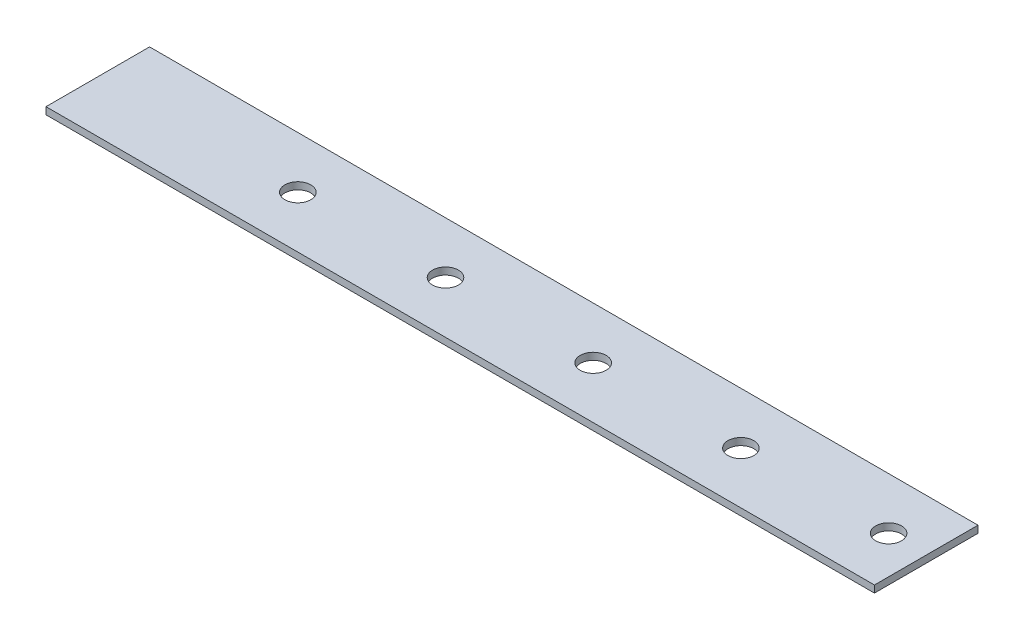
ISO-10303-21;
HEADER;
FILE_DESCRIPTION(('STEP AP214'),'2;1');
FILE_NAME('part.step','',(''),(''),'','','');
FILE_SCHEMA(('AUTOMOTIVE_DESIGN { 1 0 10303 214 1 1 1 1 }'));
ENDSEC;
DATA;
#1=APPLICATION_CONTEXT('core data for automotive mechanical design processes');
#2=APPLICATION_PROTOCOL_DEFINITION('international standard','automotive_design',2000,#1);
#3=PRODUCT_CONTEXT('',#1,'mechanical');
#4=PRODUCT('Part','Part','',(#3));
#5=PRODUCT_RELATED_PRODUCT_CATEGORY('part','',(#4));
#6=PRODUCT_DEFINITION_FORMATION('','',#4);
#7=PRODUCT_DEFINITION_CONTEXT('part definition',#1,'design');
#8=PRODUCT_DEFINITION('design','',#6,#7);
#9=PRODUCT_DEFINITION_SHAPE('','',#8);
#10=(LENGTH_UNIT() NAMED_UNIT(*) SI_UNIT(.MILLI.,.METRE.));
#11=(NAMED_UNIT(*) PLANE_ANGLE_UNIT() SI_UNIT($,.RADIAN.));
#12=(NAMED_UNIT(*) SI_UNIT($,.STERADIAN.) SOLID_ANGLE_UNIT());
#13=UNCERTAINTY_MEASURE_WITH_UNIT(LENGTH_MEASURE(1.E-05),#10,'distance_accuracy_value','');
#14=(GEOMETRIC_REPRESENTATION_CONTEXT(3) GLOBAL_UNCERTAINTY_ASSIGNED_CONTEXT((#13)) GLOBAL_UNIT_ASSIGNED_CONTEXT((#10,
#11,#12)) REPRESENTATION_CONTEXT('',''));
#15=CARTESIAN_POINT('',(0.,0.,0.));
#16=DIRECTION('',(0.,0.,1.));
#17=DIRECTION('',(1.,0.,0.));
#18=AXIS2_PLACEMENT_3D('',#15,#16,#17);
#19=CARTESIAN_POINT('',(88.,-1.5,11.));
#20=DIRECTION('',(1.,0.,0.));
#21=DIRECTION('',(0.,0.,-1.));
#22=AXIS2_PLACEMENT_3D('',#19,#20,#21);
#23=PLANE('',#22);
#24=DIRECTION('',(0.,0.,-1.));
#25=VECTOR('',#24,1.);
#26=CARTESIAN_POINT('',(88.,0.,11.));
#27=LINE('',#26,#25);
#28=CARTESIAN_POINT('',(88.,0.,11.));
#29=VERTEX_POINT('',#28);
#30=CARTESIAN_POINT('',(88.,0.,-11.));
#31=VERTEX_POINT('',#30);
#32=EDGE_CURVE('E102',#29,#31,#27,.T.);
#33=ORIENTED_EDGE('',*,*,#32,.F.);
#34=DIRECTION('',(0.,1.,0.));
#35=VECTOR('',#34,1.);
#36=CARTESIAN_POINT('',(88.,-1.5,11.));
#37=LINE('',#36,#35);
#38=CARTESIAN_POINT('',(88.,-1.5,11.));
#39=VERTEX_POINT('',#38);
#40=EDGE_CURVE('E11',#39,#29,#37,.T.);
#41=ORIENTED_EDGE('',*,*,#40,.F.);
#42=DIRECTION('',(0.,0.,-1.));
#43=VECTOR('',#42,1.);
#44=CARTESIAN_POINT('',(88.,-1.5,11.));
#45=LINE('',#44,#43);
#46=CARTESIAN_POINT('',(88.,-1.5,-11.));
#47=VERTEX_POINT('',#46);
#48=EDGE_CURVE('E95',#39,#47,#45,.T.);
#49=ORIENTED_EDGE('',*,*,#48,.T.);
#50=DIRECTION('',(0.,1.,0.));
#51=VECTOR('',#50,1.);
#52=CARTESIAN_POINT('',(88.,-1.5,-11.));
#53=LINE('',#52,#51);
#54=EDGE_CURVE('E40',#47,#31,#53,.T.);
#55=ORIENTED_EDGE('',*,*,#54,.T.);
#56=EDGE_LOOP('',(#33,#41,#49,#55));
#57=FACE_BOUND('',#56,.T.);
#58=ADVANCED_FACE('F37',(#57),#23,.T.);
#59=CARTESIAN_POINT('',(-88.,-1.5,11.));
#60=DIRECTION('',(0.,0.,1.));
#61=DIRECTION('',(1.,0.,0.));
#62=AXIS2_PLACEMENT_3D('',#59,#60,#61);
#63=PLANE('',#62);
#64=DIRECTION('',(1.,0.,0.));
#65=VECTOR('',#64,1.);
#66=CARTESIAN_POINT('',(-88.,0.,11.));
#67=LINE('',#66,#65);
#68=CARTESIAN_POINT('',(-88.,0.,11.));
#69=VERTEX_POINT('',#68);
#70=EDGE_CURVE('E97',#69,#29,#67,.T.);
#71=ORIENTED_EDGE('',*,*,#70,.F.);
#72=DIRECTION('',(0.,1.,0.));
#73=VECTOR('',#72,1.);
#74=CARTESIAN_POINT('',(-88.,-1.5,11.));
#75=LINE('',#74,#73);
#76=CARTESIAN_POINT('',(-88.,-1.5,11.));
#77=VERTEX_POINT('',#76);
#78=EDGE_CURVE('E46',#77,#69,#75,.T.);
#79=ORIENTED_EDGE('',*,*,#78,.F.);
#80=DIRECTION('',(1.,0.,0.));
#81=VECTOR('',#80,1.);
#82=CARTESIAN_POINT('',(-88.,-1.5,11.));
#83=LINE('',#82,#81);
#84=EDGE_CURVE('E92',#77,#39,#83,.T.);
#85=ORIENTED_EDGE('',*,*,#84,.T.);
#86=ORIENTED_EDGE('',*,*,#40,.T.);
#87=EDGE_LOOP('',(#71,#79,#85,#86));
#88=FACE_BOUND('',#87,.T.);
#89=ADVANCED_FACE('F113',(#88),#63,.T.);
#90=CARTESIAN_POINT('',(-88.,-1.5,11.));
#91=DIRECTION('',(-1.,0.,0.));
#92=DIRECTION('',(0.,0.,1.));
#93=AXIS2_PLACEMENT_3D('',#90,#91,#92);
#94=PLANE('',#93);
#95=DIRECTION('',(0.,0.,1.));
#96=VECTOR('',#95,1.);
#97=CARTESIAN_POINT('',(-88.,0.,11.));
#98=LINE('',#97,#96);
#99=CARTESIAN_POINT('',(-88.,0.,-11.));
#100=VERTEX_POINT('',#99);
#101=EDGE_CURVE('E87',#100,#69,#98,.T.);
#102=ORIENTED_EDGE('',*,*,#101,.F.);
#103=DIRECTION('',(0.,1.,0.));
#104=VECTOR('',#103,1.);
#105=CARTESIAN_POINT('',(-88.,-1.5,-11.));
#106=LINE('',#105,#104);
#107=CARTESIAN_POINT('',(-88.,-1.5,-11.));
#108=VERTEX_POINT('',#107);
#109=EDGE_CURVE('E82',#108,#100,#106,.T.);
#110=ORIENTED_EDGE('',*,*,#109,.F.);
#111=DIRECTION('',(0.,0.,1.));
#112=VECTOR('',#111,1.);
#113=CARTESIAN_POINT('',(-88.,-1.5,11.));
#114=LINE('',#113,#112);
#115=EDGE_CURVE('E85',#108,#77,#114,.T.);
#116=ORIENTED_EDGE('',*,*,#115,.T.);
#117=ORIENTED_EDGE('',*,*,#78,.T.);
#118=EDGE_LOOP('',(#102,#110,#116,#117));
#119=FACE_BOUND('',#118,.T.);
#120=ADVANCED_FACE('F84',(#119),#94,.T.);
#121=CARTESIAN_POINT('',(-88.,-1.5,-11.));
#122=DIRECTION('',(0.,0.,-1.));
#123=DIRECTION('',(-1.,0.,0.));
#124=AXIS2_PLACEMENT_3D('',#121,#122,#123);
#125=PLANE('',#124);
#126=DIRECTION('',(-1.,0.,0.));
#127=VECTOR('',#126,1.);
#128=CARTESIAN_POINT('',(-88.,0.,-11.));
#129=LINE('',#128,#127);
#130=EDGE_CURVE('E105',#31,#100,#129,.T.);
#131=ORIENTED_EDGE('',*,*,#130,.F.);
#132=ORIENTED_EDGE('',*,*,#54,.F.);
#133=DIRECTION('',(-1.,0.,0.));
#134=VECTOR('',#133,1.);
#135=CARTESIAN_POINT('',(-88.,-1.5,-11.));
#136=LINE('',#135,#134);
#137=EDGE_CURVE('E91',#47,#108,#136,.T.);
#138=ORIENTED_EDGE('',*,*,#137,.T.);
#139=ORIENTED_EDGE('',*,*,#109,.T.);
#140=EDGE_LOOP('',(#131,#132,#138,#139));
#141=FACE_BOUND('',#140,.T.);
#142=ADVANCED_FACE('F94',(#141),#125,.T.);
#143=CARTESIAN_POINT('',(0.,-1.5,0.));
#144=DIRECTION('',(0.,-1.,0.));
#145=DIRECTION('',(0.,0.,-1.));
#146=AXIS2_PLACEMENT_3D('',#143,#144,#145);
#147=PLANE('',#146);
#148=CARTESIAN_POINT('',(80.,-1.5,0.));
#149=DIRECTION('',(0.,1.,0.));
#150=DIRECTION('',(0.,0.,1.));
#151=AXIS2_PLACEMENT_3D('',#148,#149,#150);
#152=CIRCLE('',#151,2.75000000000001);
#153=CARTESIAN_POINT('',(80.,-1.5,2.75000000000001));
#154=VERTEX_POINT('',#153);
#155=EDGE_CURVE('E106',#154,#154,#152,.T.);
#156=ORIENTED_EDGE('',*,*,#155,.T.);
#157=EDGE_LOOP('',(#156));
#158=FACE_BOUND('',#157,.T.);
#159=CARTESIAN_POINT('',(48.625,-1.5,0.));
#160=DIRECTION('',(0.,1.,0.));
#161=DIRECTION('',(0.,0.,1.));
#162=AXIS2_PLACEMENT_3D('',#159,#160,#161);
#163=CIRCLE('',#162,2.75);
#164=CARTESIAN_POINT('',(48.625,-1.5,2.75000000000001));
#165=VERTEX_POINT('',#164);
#166=EDGE_CURVE('E161',#165,#165,#163,.T.);
#167=ORIENTED_EDGE('',*,*,#166,.T.);
#168=EDGE_LOOP('',(#167));
#169=FACE_BOUND('',#168,.T.);
#170=CARTESIAN_POINT('',(17.25,-1.5,0.));
#171=DIRECTION('',(0.,1.,0.));
#172=DIRECTION('',(0.,0.,1.));
#173=AXIS2_PLACEMENT_3D('',#170,#171,#172);
#174=CIRCLE('',#173,2.75);
#175=CARTESIAN_POINT('',(17.25,-1.5,2.75000000000001));
#176=VERTEX_POINT('',#175);
#177=EDGE_CURVE('E170',#176,#176,#174,.T.);
#178=ORIENTED_EDGE('',*,*,#177,.T.);
#179=EDGE_LOOP('',(#178));
#180=FACE_BOUND('',#179,.T.);
#181=CARTESIAN_POINT('',(-14.125,-1.5,0.));
#182=DIRECTION('',(0.,1.,0.));
#183=DIRECTION('',(0.,0.,1.));
#184=AXIS2_PLACEMENT_3D('',#181,#182,#183);
#185=CIRCLE('',#184,2.75);
#186=CARTESIAN_POINT('',(-14.125,-1.5,2.75000000000001));
#187=VERTEX_POINT('',#186);
#188=EDGE_CURVE('E176',#187,#187,#185,.T.);
#189=ORIENTED_EDGE('',*,*,#188,.T.);
#190=EDGE_LOOP('',(#189));
#191=FACE_BOUND('',#190,.T.);
#192=CARTESIAN_POINT('',(-45.5,-1.5,0.));
#193=DIRECTION('',(0.,1.,0.));
#194=DIRECTION('',(0.,0.,1.));
#195=AXIS2_PLACEMENT_3D('',#192,#193,#194);
#196=CIRCLE('',#195,2.74999999999999);
#197=CARTESIAN_POINT('',(-45.5,-1.5,2.75000000000001));
#198=VERTEX_POINT('',#197);
#199=EDGE_CURVE('E182',#198,#198,#196,.T.);
#200=ORIENTED_EDGE('',*,*,#199,.T.);
#201=EDGE_LOOP('',(#200));
#202=FACE_BOUND('',#201,.T.);
#203=ORIENTED_EDGE('',*,*,#48,.F.);
#204=ORIENTED_EDGE('',*,*,#84,.F.);
#205=ORIENTED_EDGE('',*,*,#115,.F.);
#206=ORIENTED_EDGE('',*,*,#137,.F.);
#207=EDGE_LOOP('',(#203,#204,#205,#206));
#208=FACE_BOUND('',#207,.T.);
#209=ADVANCED_FACE('F90',(#158,#169,#180,#191,#202,#208),#147,.T.);
#210=CARTESIAN_POINT('',(0.,0.,0.));
#211=DIRECTION('',(0.,-1.,0.));
#212=DIRECTION('',(0.,0.,-1.));
#213=AXIS2_PLACEMENT_3D('',#210,#211,#212);
#214=PLANE('',#213);
#215=CARTESIAN_POINT('',(80.,0.,0.));
#216=DIRECTION('',(0.,1.,0.));
#217=DIRECTION('',(0.,0.,1.));
#218=AXIS2_PLACEMENT_3D('',#215,#216,#217);
#219=CIRCLE('',#218,2.75000000000001);
#220=CARTESIAN_POINT('',(80.,0.,2.75000000000001));
#221=VERTEX_POINT('',#220);
#222=EDGE_CURVE('E160',#221,#221,#219,.T.);
#223=ORIENTED_EDGE('',*,*,#222,.F.);
#224=EDGE_LOOP('',(#223));
#225=FACE_BOUND('',#224,.T.);
#226=CARTESIAN_POINT('',(48.625,0.,0.));
#227=DIRECTION('',(0.,1.,0.));
#228=DIRECTION('',(0.,0.,1.));
#229=AXIS2_PLACEMENT_3D('',#226,#227,#228);
#230=CIRCLE('',#229,2.75);
#231=CARTESIAN_POINT('',(48.625,0.,2.75000000000001));
#232=VERTEX_POINT('',#231);
#233=EDGE_CURVE('E165',#232,#232,#230,.T.);
#234=ORIENTED_EDGE('',*,*,#233,.F.);
#235=EDGE_LOOP('',(#234));
#236=FACE_BOUND('',#235,.T.);
#237=CARTESIAN_POINT('',(17.25,0.,0.));
#238=DIRECTION('',(0.,1.,0.));
#239=DIRECTION('',(0.,0.,1.));
#240=AXIS2_PLACEMENT_3D('',#237,#238,#239);
#241=CIRCLE('',#240,2.75);
#242=CARTESIAN_POINT('',(17.25,0.,2.75000000000001));
#243=VERTEX_POINT('',#242);
#244=EDGE_CURVE('E173',#243,#243,#241,.T.);
#245=ORIENTED_EDGE('',*,*,#244,.F.);
#246=EDGE_LOOP('',(#245));
#247=FACE_BOUND('',#246,.T.);
#248=CARTESIAN_POINT('',(-14.125,0.,0.));
#249=DIRECTION('',(0.,1.,0.));
#250=DIRECTION('',(0.,0.,1.));
#251=AXIS2_PLACEMENT_3D('',#248,#249,#250);
#252=CIRCLE('',#251,2.75);
#253=CARTESIAN_POINT('',(-14.125,0.,2.75000000000001));
#254=VERTEX_POINT('',#253);
#255=EDGE_CURVE('E179',#254,#254,#252,.T.);
#256=ORIENTED_EDGE('',*,*,#255,.F.);
#257=EDGE_LOOP('',(#256));
#258=FACE_BOUND('',#257,.T.);
#259=CARTESIAN_POINT('',(-45.5,0.,0.));
#260=DIRECTION('',(0.,1.,0.));
#261=DIRECTION('',(0.,0.,1.));
#262=AXIS2_PLACEMENT_3D('',#259,#260,#261);
#263=CIRCLE('',#262,2.74999999999999);
#264=CARTESIAN_POINT('',(-45.5,0.,2.75000000000001));
#265=VERTEX_POINT('',#264);
#266=EDGE_CURVE('E184',#265,#265,#263,.T.);
#267=ORIENTED_EDGE('',*,*,#266,.F.);
#268=EDGE_LOOP('',(#267));
#269=FACE_BOUND('',#268,.T.);
#270=ORIENTED_EDGE('',*,*,#32,.T.);
#271=ORIENTED_EDGE('',*,*,#130,.T.);
#272=ORIENTED_EDGE('',*,*,#101,.T.);
#273=ORIENTED_EDGE('',*,*,#70,.T.);
#274=EDGE_LOOP('',(#270,#271,#272,#273));
#275=FACE_BOUND('',#274,.T.);
#276=ADVANCED_FACE('F112',(#225,#236,#247,#258,#269,#275),#214,.F.);
#277=CARTESIAN_POINT('',(-45.5,-1.5,0.));
#278=DIRECTION('',(0.,1.,0.));
#279=DIRECTION('',(0.,0.,1.));
#280=AXIS2_PLACEMENT_3D('',#277,#278,#279);
#281=CYLINDRICAL_SURFACE('',#280,2.74999999999999);
#282=ORIENTED_EDGE('',*,*,#199,.F.);
#283=EDGE_LOOP('',(#282));
#284=FACE_BOUND('',#283,.T.);
#285=ORIENTED_EDGE('',*,*,#266,.T.);
#286=EDGE_LOOP('',(#285));
#287=FACE_BOUND('',#286,.T.);
#288=ADVANCED_FACE('F131',(#284,#287),#281,.F.);
#289=CARTESIAN_POINT('',(-14.125,-1.5,0.));
#290=DIRECTION('',(0.,1.,0.));
#291=DIRECTION('',(0.,0.,1.));
#292=AXIS2_PLACEMENT_3D('',#289,#290,#291);
#293=CYLINDRICAL_SURFACE('',#292,2.75);
#294=ORIENTED_EDGE('',*,*,#188,.F.);
#295=EDGE_LOOP('',(#294));
#296=FACE_BOUND('',#295,.T.);
#297=ORIENTED_EDGE('',*,*,#255,.T.);
#298=EDGE_LOOP('',(#297));
#299=FACE_BOUND('',#298,.T.);
#300=ADVANCED_FACE('F138',(#296,#299),#293,.F.);
#301=CARTESIAN_POINT('',(17.25,-1.5,0.));
#302=DIRECTION('',(0.,1.,0.));
#303=DIRECTION('',(0.,0.,1.));
#304=AXIS2_PLACEMENT_3D('',#301,#302,#303);
#305=CYLINDRICAL_SURFACE('',#304,2.75);
#306=ORIENTED_EDGE('',*,*,#177,.F.);
#307=EDGE_LOOP('',(#306));
#308=FACE_BOUND('',#307,.T.);
#309=ORIENTED_EDGE('',*,*,#244,.T.);
#310=EDGE_LOOP('',(#309));
#311=FACE_BOUND('',#310,.T.);
#312=ADVANCED_FACE('F142',(#308,#311),#305,.F.);
#313=CARTESIAN_POINT('',(48.625,-1.5,0.));
#314=DIRECTION('',(0.,1.,0.));
#315=DIRECTION('',(0.,0.,1.));
#316=AXIS2_PLACEMENT_3D('',#313,#314,#315);
#317=CYLINDRICAL_SURFACE('',#316,2.75);
#318=ORIENTED_EDGE('',*,*,#166,.F.);
#319=EDGE_LOOP('',(#318));
#320=FACE_BOUND('',#319,.T.);
#321=ORIENTED_EDGE('',*,*,#233,.T.);
#322=EDGE_LOOP('',(#321));
#323=FACE_BOUND('',#322,.T.);
#324=ADVANCED_FACE('F146',(#320,#323),#317,.F.);
#325=CARTESIAN_POINT('',(80.,-1.5,0.));
#326=DIRECTION('',(0.,1.,0.));
#327=DIRECTION('',(0.,0.,1.));
#328=AXIS2_PLACEMENT_3D('',#325,#326,#327);
#329=CYLINDRICAL_SURFACE('',#328,2.75000000000001);
#330=ORIENTED_EDGE('',*,*,#155,.F.);
#331=EDGE_LOOP('',(#330));
#332=FACE_BOUND('',#331,.T.);
#333=ORIENTED_EDGE('',*,*,#222,.T.);
#334=EDGE_LOOP('',(#333));
#335=FACE_BOUND('',#334,.T.);
#336=ADVANCED_FACE('F150',(#332,#335),#329,.F.);
#337=CLOSED_SHELL('',(#58,#89,#120,#142,#209,#276,#288,#300,#312,#324,#336));
#338=MANIFOLD_SOLID_BREP('B2',#337);
#339=ADVANCED_BREP_SHAPE_REPRESENTATION('',(#18,#338),#14);
#340=SHAPE_DEFINITION_REPRESENTATION(#9,#339);
ENDSEC;
END-ISO-10303-21;
